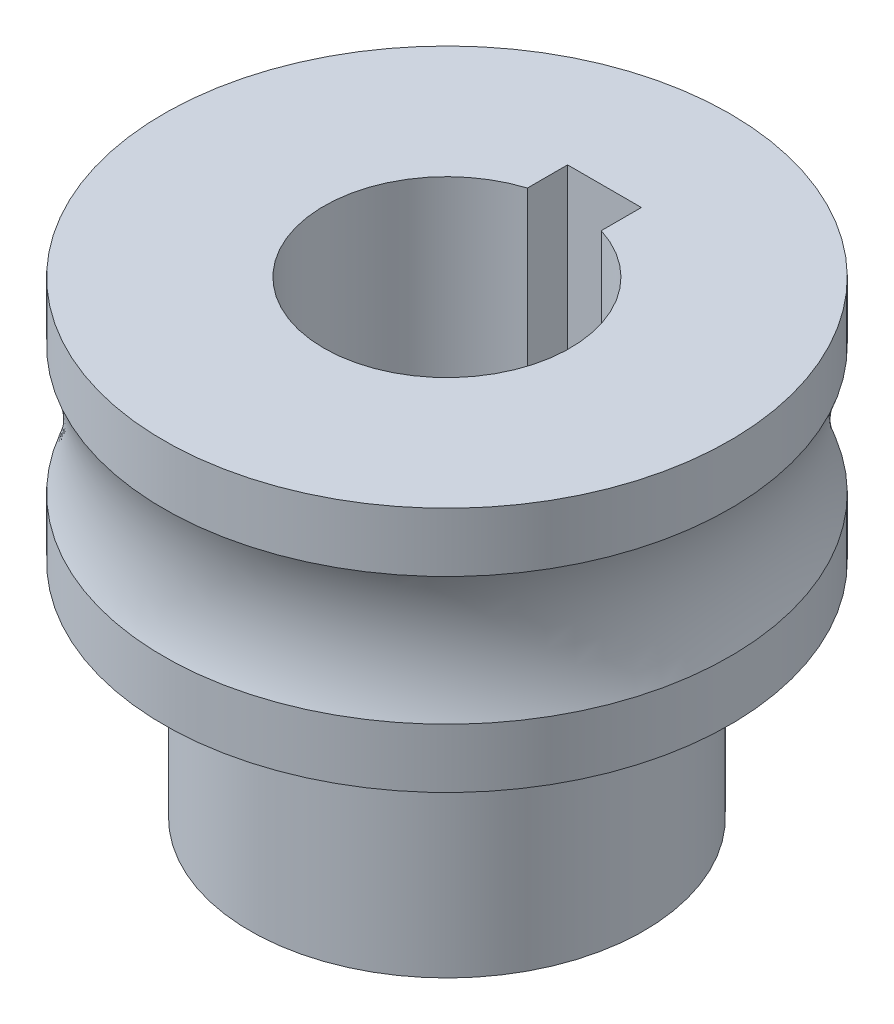
ISO-10303-21;
HEADER;
FILE_DESCRIPTION(('STEP AP214'),'2;1');
FILE_NAME('part.step','',(''),(''),'','','');
FILE_SCHEMA(('AUTOMOTIVE_DESIGN { 1 0 10303 214 1 1 1 1 }'));
ENDSEC;
DATA;
#1=APPLICATION_CONTEXT('core data for automotive mechanical design processes');
#2=APPLICATION_PROTOCOL_DEFINITION('international standard','automotive_design',2000,#1);
#3=PRODUCT_CONTEXT('',#1,'mechanical');
#4=PRODUCT('Part','Part','',(#3));
#5=PRODUCT_RELATED_PRODUCT_CATEGORY('part','',(#4));
#6=PRODUCT_DEFINITION_FORMATION('','',#4);
#7=PRODUCT_DEFINITION_CONTEXT('part definition',#1,'design');
#8=PRODUCT_DEFINITION('design','',#6,#7);
#9=PRODUCT_DEFINITION_SHAPE('','',#8);
#10=(LENGTH_UNIT() NAMED_UNIT(*) SI_UNIT(.MILLI.,.METRE.));
#11=(NAMED_UNIT(*) PLANE_ANGLE_UNIT() SI_UNIT($,.RADIAN.));
#12=(NAMED_UNIT(*) SI_UNIT($,.STERADIAN.) SOLID_ANGLE_UNIT());
#13=UNCERTAINTY_MEASURE_WITH_UNIT(LENGTH_MEASURE(1.E-05),#10,'distance_accuracy_value','');
#14=(GEOMETRIC_REPRESENTATION_CONTEXT(3) GLOBAL_UNCERTAINTY_ASSIGNED_CONTEXT((#13)) GLOBAL_UNIT_ASSIGNED_CONTEXT((#10,
#11,#12)) REPRESENTATION_CONTEXT('',''));
#15=CARTESIAN_POINT('',(0.,0.,0.));
#16=DIRECTION('',(0.,0.,1.));
#17=DIRECTION('',(1.,0.,0.));
#18=AXIS2_PLACEMENT_3D('',#15,#16,#17);
#19=CARTESIAN_POINT('',(0.,-15.,0.));
#20=DIRECTION('',(0.,-1.,0.));
#21=DIRECTION('',(0.,0.,-1.));
#22=AXIS2_PLACEMENT_3D('',#19,#20,#21);
#23=CYLINDRICAL_SURFACE('',#22,5.);
#24=DIRECTION('',(0.,-1.,0.));
#25=VECTOR('',#24,1.);
#26=CARTESIAN_POINT('',(1.5,-15.,-4.76969600708473));
#27=LINE('',#26,#25);
#28=CARTESIAN_POINT('',(1.5,-14.,-4.76969600708473));
#29=VERTEX_POINT('',#28);
#30=CARTESIAN_POINT('',(1.5,5.,-4.76969600708473));
#31=VERTEX_POINT('',#30);
#32=EDGE_CURVE('E57',#29,#31,#27,.F.);
#33=ORIENTED_EDGE('',*,*,#32,.F.);
#34=CARTESIAN_POINT('',(0.,-14.,0.));
#35=DIRECTION('',(0.,-1.,0.));
#36=DIRECTION('',(0.,0.,-1.));
#37=AXIS2_PLACEMENT_3D('',#34,#35,#36);
#38=CIRCLE('',#37,5.);
#39=CARTESIAN_POINT('',(-1.5,-14.,-4.76969600708473));
#40=VERTEX_POINT('',#39);
#41=EDGE_CURVE('E221',#29,#40,#38,.T.);
#42=ORIENTED_EDGE('',*,*,#41,.T.);
#43=DIRECTION('',(0.,-1.,0.));
#44=VECTOR('',#43,1.);
#45=CARTESIAN_POINT('',(-1.5,-15.,-4.76969600708473));
#46=LINE('',#45,#44);
#47=CARTESIAN_POINT('',(-1.5,5.,-4.76969600708473));
#48=VERTEX_POINT('',#47);
#49=EDGE_CURVE('E88',#48,#40,#46,.T.);
#50=ORIENTED_EDGE('',*,*,#49,.F.);
#51=CARTESIAN_POINT('',(0.,5.,0.));
#52=DIRECTION('',(0.,-1.,0.));
#53=DIRECTION('',(0.,0.,-1.));
#54=AXIS2_PLACEMENT_3D('',#51,#52,#53);
#55=CIRCLE('',#54,5.);
#56=EDGE_CURVE('E116',#31,#48,#55,.T.);
#57=ORIENTED_EDGE('',*,*,#56,.F.);
#58=EDGE_LOOP('',(#33,#42,#50,#57));
#59=FACE_BOUND('',#58,.T.);
#60=ADVANCED_FACE('F36',(#59),#23,.F.);
#61=CARTESIAN_POINT('',(0.,-15.,0.));
#62=DIRECTION('',(0.,-1.,0.));
#63=DIRECTION('',(0.,0.,-1.));
#64=AXIS2_PLACEMENT_3D('',#61,#62,#63);
#65=CYLINDRICAL_SURFACE('',#64,8.);
#66=CARTESIAN_POINT('',(0.,-5.,0.));
#67=DIRECTION('',(0.,-1.,0.));
#68=DIRECTION('',(0.,0.,-1.));
#69=AXIS2_PLACEMENT_3D('',#66,#67,#68);
#70=CIRCLE('',#69,8.);
#71=CARTESIAN_POINT('',(0.,-5.,-8.));
#72=VERTEX_POINT('',#71);
#73=EDGE_CURVE('E113',#72,#72,#70,.T.);
#74=ORIENTED_EDGE('',*,*,#73,.T.);
#75=EDGE_LOOP('',(#74));
#76=FACE_BOUND('',#75,.T.);
#77=CARTESIAN_POINT('',(0.,-14.,0.));
#78=DIRECTION('',(0.,-1.,0.));
#79=DIRECTION('',(0.,0.,-1.));
#80=AXIS2_PLACEMENT_3D('',#77,#78,#79);
#81=CIRCLE('',#80,8.);
#82=CARTESIAN_POINT('',(0.,-14.,-8.));
#83=VERTEX_POINT('',#82);
#84=EDGE_CURVE('E89',#83,#83,#81,.T.);
#85=ORIENTED_EDGE('',*,*,#84,.F.);
#86=EDGE_LOOP('',(#85));
#87=FACE_BOUND('',#86,.T.);
#88=ADVANCED_FACE('F136',(#76,#87),#65,.T.);
#89=CARTESIAN_POINT('',(1.5,-15.,-3.6));
#90=DIRECTION('',(1.,0.,0.));
#91=DIRECTION('',(0.,0.,-1.));
#92=AXIS2_PLACEMENT_3D('',#89,#90,#91);
#93=PLANE('',#92);
#94=DIRECTION('',(0.,0.,-1.));
#95=VECTOR('',#94,1.);
#96=CARTESIAN_POINT('',(1.5,-14.,-3.6));
#97=LINE('',#96,#95);
#98=CARTESIAN_POINT('',(1.5,-14.,-6.4));
#99=VERTEX_POINT('',#98);
#100=EDGE_CURVE('E50',#29,#99,#97,.T.);
#101=ORIENTED_EDGE('',*,*,#100,.F.);
#102=ORIENTED_EDGE('',*,*,#32,.T.);
#103=DIRECTION('',(0.,0.,-1.));
#104=VECTOR('',#103,1.);
#105=CARTESIAN_POINT('',(1.5,5.,-3.6));
#106=LINE('',#105,#104);
#107=CARTESIAN_POINT('',(1.5,5.,-6.4));
#108=VERTEX_POINT('',#107);
#109=EDGE_CURVE('E224',#31,#108,#106,.T.);
#110=ORIENTED_EDGE('',*,*,#109,.T.);
#111=DIRECTION('',(0.,1.,0.));
#112=VECTOR('',#111,1.);
#113=CARTESIAN_POINT('',(1.5,-15.,-6.4));
#114=LINE('',#113,#112);
#115=EDGE_CURVE('E95',#99,#108,#114,.T.);
#116=ORIENTED_EDGE('',*,*,#115,.F.);
#117=EDGE_LOOP('',(#101,#102,#110,#116));
#118=FACE_BOUND('',#117,.T.);
#119=ADVANCED_FACE('F141',(#118),#93,.F.);
#120=CARTESIAN_POINT('',(-1.5,-15.,-3.6));
#121=DIRECTION('',(-1.,0.,0.));
#122=DIRECTION('',(0.,0.,1.));
#123=AXIS2_PLACEMENT_3D('',#120,#121,#122);
#124=PLANE('',#123);
#125=DIRECTION('',(0.,0.,1.));
#126=VECTOR('',#125,1.);
#127=CARTESIAN_POINT('',(-1.5,-14.,-3.6));
#128=LINE('',#127,#126);
#129=CARTESIAN_POINT('',(-1.5,-14.,-6.4));
#130=VERTEX_POINT('',#129);
#131=EDGE_CURVE('E77',#130,#40,#128,.T.);
#132=ORIENTED_EDGE('',*,*,#131,.F.);
#133=DIRECTION('',(0.,1.,0.));
#134=VECTOR('',#133,1.);
#135=CARTESIAN_POINT('',(-1.5,-15.,-6.4));
#136=LINE('',#135,#134);
#137=CARTESIAN_POINT('',(-1.5,5.,-6.4));
#138=VERTEX_POINT('',#137);
#139=EDGE_CURVE('E85',#130,#138,#136,.T.);
#140=ORIENTED_EDGE('',*,*,#139,.T.);
#141=DIRECTION('',(0.,0.,1.));
#142=VECTOR('',#141,1.);
#143=CARTESIAN_POINT('',(-1.5,5.,-3.6));
#144=LINE('',#143,#142);
#145=EDGE_CURVE('E98',#138,#48,#144,.T.);
#146=ORIENTED_EDGE('',*,*,#145,.T.);
#147=ORIENTED_EDGE('',*,*,#49,.T.);
#148=EDGE_LOOP('',(#132,#140,#146,#147));
#149=FACE_BOUND('',#148,.T.);
#150=ADVANCED_FACE('F84',(#149),#124,.F.);
#151=CARTESIAN_POINT('',(-1.5,-15.,-6.4));
#152=DIRECTION('',(0.,0.,-1.));
#153=DIRECTION('',(-1.,0.,0.));
#154=AXIS2_PLACEMENT_3D('',#151,#152,#153);
#155=PLANE('',#154);
#156=DIRECTION('',(-1.,0.,0.));
#157=VECTOR('',#156,1.);
#158=CARTESIAN_POINT('',(-1.5,-14.,-6.4));
#159=LINE('',#158,#157);
#160=EDGE_CURVE('E11',#99,#130,#159,.T.);
#161=ORIENTED_EDGE('',*,*,#160,.F.);
#162=ORIENTED_EDGE('',*,*,#115,.T.);
#163=DIRECTION('',(-1.,0.,0.));
#164=VECTOR('',#163,1.);
#165=CARTESIAN_POINT('',(-1.5,5.,-6.4));
#166=LINE('',#165,#164);
#167=EDGE_CURVE('E93',#108,#138,#166,.T.);
#168=ORIENTED_EDGE('',*,*,#167,.T.);
#169=ORIENTED_EDGE('',*,*,#139,.F.);
#170=EDGE_LOOP('',(#161,#162,#168,#169));
#171=FACE_BOUND('',#170,.T.);
#172=ADVANCED_FACE('F91',(#171),#155,.F.);
#173=CARTESIAN_POINT('',(0.,-15.,0.));
#174=DIRECTION('',(0.,-1.,0.));
#175=DIRECTION('',(0.,0.,-1.));
#176=AXIS2_PLACEMENT_3D('',#173,#174,#175);
#177=CYLINDRICAL_SURFACE('',#176,11.5);
#178=CARTESIAN_POINT('',(0.,5.,0.));
#179=DIRECTION('',(0.,-1.,0.));
#180=DIRECTION('',(0.,0.,-1.));
#181=AXIS2_PLACEMENT_3D('',#178,#179,#180);
#182=CIRCLE('',#181,11.5);
#183=CARTESIAN_POINT('',(0.,5.,-11.5));
#184=VERTEX_POINT('',#183);
#185=EDGE_CURVE('E44',#184,#184,#182,.T.);
#186=ORIENTED_EDGE('',*,*,#185,.T.);
#187=EDGE_LOOP('',(#186));
#188=FACE_BOUND('',#187,.T.);
#189=CARTESIAN_POINT('',(0.,2.59807621135332,0.));
#190=DIRECTION('',(0.,-1.,0.));
#191=DIRECTION('',(0.,0.,-1.));
#192=AXIS2_PLACEMENT_3D('',#189,#190,#191);
#193=CIRCLE('',#192,11.5);
#194=CARTESIAN_POINT('',(0.,2.59807621135332,-11.5));
#195=VERTEX_POINT('',#194);
#196=EDGE_CURVE('E104',#195,#195,#193,.T.);
#197=ORIENTED_EDGE('',*,*,#196,.F.);
#198=EDGE_LOOP('',(#197));
#199=FACE_BOUND('',#198,.T.);
#200=ADVANCED_FACE('F38',(#188,#199),#177,.T.);
#201=CARTESIAN_POINT('',(11.5,5.,0.));
#202=DIRECTION('',(0.,1.,0.));
#203=DIRECTION('',(0.,0.,1.));
#204=AXIS2_PLACEMENT_3D('',#201,#202,#203);
#205=PLANE('',#204);
#206=ORIENTED_EDGE('',*,*,#109,.F.);
#207=ORIENTED_EDGE('',*,*,#56,.T.);
#208=ORIENTED_EDGE('',*,*,#145,.F.);
#209=ORIENTED_EDGE('',*,*,#167,.F.);
#210=EDGE_LOOP('',(#206,#207,#208,#209));
#211=FACE_BOUND('',#210,.T.);
#212=ORIENTED_EDGE('',*,*,#185,.F.);
#213=EDGE_LOOP('',(#212));
#214=FACE_BOUND('',#213,.T.);
#215=ADVANCED_FACE('F123',(#211,#214),#205,.T.);
#216=CARTESIAN_POINT('',(8.,-5.,0.));
#217=DIRECTION('',(0.,-1.,0.));
#218=DIRECTION('',(0.,0.,-1.));
#219=AXIS2_PLACEMENT_3D('',#216,#217,#218);
#220=PLANE('',#219);
#221=CARTESIAN_POINT('',(0.,-5.,0.));
#222=DIRECTION('',(0.,-1.,0.));
#223=DIRECTION('',(0.,0.,-1.));
#224=AXIS2_PLACEMENT_3D('',#221,#222,#223);
#225=CIRCLE('',#224,11.5);
#226=CARTESIAN_POINT('',(0.,-5.,-11.5));
#227=VERTEX_POINT('',#226);
#228=EDGE_CURVE('E110',#227,#227,#225,.T.);
#229=ORIENTED_EDGE('',*,*,#228,.T.);
#230=EDGE_LOOP('',(#229));
#231=FACE_BOUND('',#230,.T.);
#232=ORIENTED_EDGE('',*,*,#73,.F.);
#233=EDGE_LOOP('',(#232));
#234=FACE_BOUND('',#233,.T.);
#235=ADVANCED_FACE('F125',(#231,#234),#220,.T.);
#236=CARTESIAN_POINT('',(0.,-15.,0.));
#237=DIRECTION('',(0.,-1.,0.));
#238=DIRECTION('',(0.,0.,-1.));
#239=AXIS2_PLACEMENT_3D('',#236,#237,#238);
#240=CYLINDRICAL_SURFACE('',#239,11.5);
#241=CARTESIAN_POINT('',(0.,-2.59807621135332,0.));
#242=DIRECTION('',(0.,-1.,0.));
#243=DIRECTION('',(0.,0.,-1.));
#244=AXIS2_PLACEMENT_3D('',#241,#242,#243);
#245=CIRCLE('',#244,11.5);
#246=CARTESIAN_POINT('',(0.,-2.59807621135332,-11.5));
#247=VERTEX_POINT('',#246);
#248=EDGE_CURVE('E107',#247,#247,#245,.T.);
#249=ORIENTED_EDGE('',*,*,#248,.T.);
#250=EDGE_LOOP('',(#249));
#251=FACE_BOUND('',#250,.T.);
#252=ORIENTED_EDGE('',*,*,#228,.F.);
#253=EDGE_LOOP('',(#252));
#254=FACE_BOUND('',#253,.T.);
#255=ADVANCED_FACE('F131',(#251,#254),#240,.T.);
#256=CARTESIAN_POINT('',(0.,0.,0.));
#257=DIRECTION('',(0.,-1.,0.));
#258=DIRECTION('',(0.,0.,-1.));
#259=AXIS2_PLACEMENT_3D('',#256,#257,#258);
#260=TOROIDAL_SURFACE('',#259,18.,7.);
#261=ORIENTED_EDGE('',*,*,#248,.F.);
#262=EDGE_LOOP('',(#261));
#263=FACE_BOUND('',#262,.T.);
#264=ORIENTED_EDGE('',*,*,#196,.T.);
#265=EDGE_LOOP('',(#264));
#266=FACE_BOUND('',#265,.T.);
#267=ADVANCED_FACE('F147',(#263,#266),#260,.F.);
#268=CARTESIAN_POINT('',(0.,-14.,0.));
#269=DIRECTION('',(0.,-1.,0.));
#270=DIRECTION('',(0.,0.,-1.));
#271=AXIS2_PLACEMENT_3D('',#268,#269,#270);
#272=PLANE('',#271);
#273=ORIENTED_EDGE('',*,*,#100,.T.);
#274=ORIENTED_EDGE('',*,*,#160,.T.);
#275=ORIENTED_EDGE('',*,*,#131,.T.);
#276=ORIENTED_EDGE('',*,*,#41,.F.);
#277=EDGE_LOOP('',(#273,#274,#275,#276));
#278=FACE_BOUND('',#277,.T.);
#279=ORIENTED_EDGE('',*,*,#84,.T.);
#280=EDGE_LOOP('',(#279));
#281=FACE_BOUND('',#280,.T.);
#282=ADVANCED_FACE('F75',(#278,#281),#272,.T.);
#283=CLOSED_SHELL('',(#60,#88,#119,#150,#172,#200,#215,#235,#255,#267,#282));
#284=MANIFOLD_SOLID_BREP('B2',#283);
#285=ADVANCED_BREP_SHAPE_REPRESENTATION('',(#18,#284),#14);
#286=SHAPE_DEFINITION_REPRESENTATION(#9,#285);
ENDSEC;
END-ISO-10303-21;
